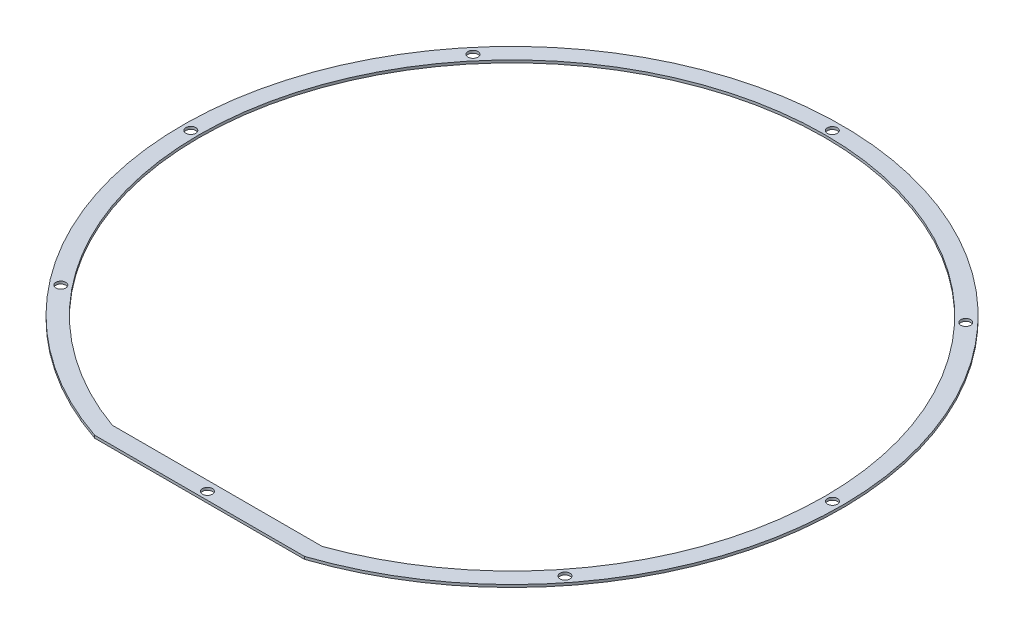
ISO-10303-21;
HEADER;
FILE_DESCRIPTION(('STEP AP214'),'2;1');
FILE_NAME('part.step','',(''),(''),'','','');
FILE_SCHEMA(('AUTOMOTIVE_DESIGN { 1 0 10303 214 1 1 1 1 }'));
ENDSEC;
DATA;
#1=APPLICATION_CONTEXT('core data for automotive mechanical design processes');
#2=APPLICATION_PROTOCOL_DEFINITION('international standard','automotive_design',2000,#1);
#3=PRODUCT_CONTEXT('',#1,'mechanical');
#4=PRODUCT('Part','Part','',(#3));
#5=PRODUCT_RELATED_PRODUCT_CATEGORY('part','',(#4));
#6=PRODUCT_DEFINITION_FORMATION('','',#4);
#7=PRODUCT_DEFINITION_CONTEXT('part definition',#1,'design');
#8=PRODUCT_DEFINITION('design','',#6,#7);
#9=PRODUCT_DEFINITION_SHAPE('','',#8);
#10=(LENGTH_UNIT() NAMED_UNIT(*) SI_UNIT(.MILLI.,.METRE.));
#11=(NAMED_UNIT(*) PLANE_ANGLE_UNIT() SI_UNIT($,.RADIAN.));
#12=(NAMED_UNIT(*) SI_UNIT($,.STERADIAN.) SOLID_ANGLE_UNIT());
#13=UNCERTAINTY_MEASURE_WITH_UNIT(LENGTH_MEASURE(1.E-05),#10,'distance_accuracy_value','');
#14=(GEOMETRIC_REPRESENTATION_CONTEXT(3) GLOBAL_UNCERTAINTY_ASSIGNED_CONTEXT((#13)) GLOBAL_UNIT_ASSIGNED_CONTEXT((#10,
#11,#12)) REPRESENTATION_CONTEXT('',''));
#15=CARTESIAN_POINT('',(0.,0.,0.));
#16=DIRECTION('',(0.,0.,1.));
#17=DIRECTION('',(1.,0.,0.));
#18=AXIS2_PLACEMENT_3D('',#15,#16,#17);
#19=CARTESIAN_POINT('',(-25.4,0.,75.6286215661769));
#20=DIRECTION('',(0.,0.,1.));
#21=DIRECTION('',(1.,0.,0.));
#22=AXIS2_PLACEMENT_3D('',#19,#20,#21);
#23=PLANE('',#22);
#24=DIRECTION('',(0.,1.,0.));
#25=VECTOR('',#24,1.);
#26=CARTESIAN_POINT('',(-25.4,0.,75.6286215661769));
#27=LINE('',#26,#25);
#28=CARTESIAN_POINT('',(-25.4,0.,75.6286215661769));
#29=VERTEX_POINT('',#28);
#30=CARTESIAN_POINT('',(-25.4,0.625,75.6286215661769));
#31=VERTEX_POINT('',#30);
#32=EDGE_CURVE('E13',#29,#31,#27,.T.);
#33=ORIENTED_EDGE('',*,*,#32,.F.);
#34=DIRECTION('',(1.,0.,0.));
#35=VECTOR('',#34,1.);
#36=CARTESIAN_POINT('',(-25.4,0.,75.6286215661769));
#37=LINE('',#36,#35);
#38=CARTESIAN_POINT('',(25.4,0.,75.6286215661769));
#39=VERTEX_POINT('',#38);
#40=EDGE_CURVE('E146',#29,#39,#37,.T.);
#41=ORIENTED_EDGE('',*,*,#40,.T.);
#42=DIRECTION('',(0.,1.,0.));
#43=VECTOR('',#42,1.);
#44=CARTESIAN_POINT('',(25.4,0.,75.6286215661769));
#45=LINE('',#44,#43);
#46=CARTESIAN_POINT('',(25.4,0.625,75.6286215661769));
#47=VERTEX_POINT('',#46);
#48=EDGE_CURVE('E71',#39,#47,#45,.T.);
#49=ORIENTED_EDGE('',*,*,#48,.T.);
#50=DIRECTION('',(1.,0.,0.));
#51=VECTOR('',#50,1.);
#52=CARTESIAN_POINT('',(0.,0.625,75.6286215661769));
#53=LINE('',#52,#51);
#54=EDGE_CURVE('E125',#31,#47,#53,.T.);
#55=ORIENTED_EDGE('',*,*,#54,.F.);
#56=EDGE_LOOP('',(#33,#41,#49,#55));
#57=FACE_BOUND('',#56,.T.);
#58=ADVANCED_FACE('F60',(#57),#23,.T.);
#59=CARTESIAN_POINT('',(0.,0.,0.));
#60=DIRECTION('',(0.,1.,0.));
#61=DIRECTION('',(0.,0.,1.));
#62=AXIS2_PLACEMENT_3D('',#59,#60,#61);
#63=CYLINDRICAL_SURFACE('',#62,75.78);
#64=DIRECTION('',(0.,1.,0.));
#65=VECTOR('',#64,1.);
#66=CARTESIAN_POINT('',(-25.4,0.,71.3964172770595));
#67=LINE('',#66,#65);
#68=CARTESIAN_POINT('',(-25.4,0.,71.3964172770595));
#69=VERTEX_POINT('',#68);
#70=CARTESIAN_POINT('',(-25.4,0.625,71.3964172770595));
#71=VERTEX_POINT('',#70);
#72=EDGE_CURVE('E107',#69,#71,#67,.T.);
#73=ORIENTED_EDGE('',*,*,#72,.F.);
#74=CARTESIAN_POINT('',(0.,0.,0.));
#75=DIRECTION('',(0.,1.,0.));
#76=DIRECTION('',(0.,0.,1.));
#77=AXIS2_PLACEMENT_3D('',#74,#75,#76);
#78=CIRCLE('',#77,75.78);
#79=CARTESIAN_POINT('',(25.4,0.,71.3964172770595));
#80=VERTEX_POINT('',#79);
#81=EDGE_CURVE('E138',#80,#69,#78,.T.);
#82=ORIENTED_EDGE('',*,*,#81,.F.);
#83=DIRECTION('',(0.,1.,0.));
#84=VECTOR('',#83,1.);
#85=CARTESIAN_POINT('',(25.4,0.,71.3964172770595));
#86=LINE('',#85,#84);
#87=CARTESIAN_POINT('',(25.4,0.625,71.3964172770595));
#88=VERTEX_POINT('',#87);
#89=EDGE_CURVE('E101',#80,#88,#86,.T.);
#90=ORIENTED_EDGE('',*,*,#89,.T.);
#91=CARTESIAN_POINT('',(0.,0.625,0.));
#92=DIRECTION('',(0.,1.,0.));
#93=DIRECTION('',(0.,0.,1.));
#94=AXIS2_PLACEMENT_3D('',#91,#92,#93);
#95=CIRCLE('',#94,75.78);
#96=EDGE_CURVE('E116',#88,#71,#95,.T.);
#97=ORIENTED_EDGE('',*,*,#96,.T.);
#98=EDGE_LOOP('',(#73,#82,#90,#97));
#99=FACE_BOUND('',#98,.T.);
#100=ADVANCED_FACE('F117',(#99),#63,.F.);
#101=CARTESIAN_POINT('',(-25.4,0.,71.3964172770595));
#102=DIRECTION('',(0.,0.,1.));
#103=DIRECTION('',(1.,0.,0.));
#104=AXIS2_PLACEMENT_3D('',#101,#102,#103);
#105=PLANE('',#104);
#106=DIRECTION('',(1.,0.,0.));
#107=VECTOR('',#106,1.);
#108=CARTESIAN_POINT('',(-25.4,0.,71.3964172770595));
#109=LINE('',#108,#107);
#110=EDGE_CURVE('E112',#69,#80,#109,.T.);
#111=ORIENTED_EDGE('',*,*,#110,.F.);
#112=ORIENTED_EDGE('',*,*,#72,.T.);
#113=DIRECTION('',(1.,0.,0.));
#114=VECTOR('',#113,1.);
#115=CARTESIAN_POINT('',(0.,0.625,71.3964172770595));
#116=LINE('',#115,#114);
#117=EDGE_CURVE('E110',#71,#88,#116,.T.);
#118=ORIENTED_EDGE('',*,*,#117,.T.);
#119=ORIENTED_EDGE('',*,*,#89,.F.);
#120=EDGE_LOOP('',(#111,#112,#118,#119));
#121=FACE_BOUND('',#120,.T.);
#122=ADVANCED_FACE('F108',(#121),#105,.F.);
#123=CARTESIAN_POINT('',(0.,0.,0.));
#124=DIRECTION('',(0.,1.,0.));
#125=DIRECTION('',(0.,0.,1.));
#126=AXIS2_PLACEMENT_3D('',#123,#124,#125);
#127=CYLINDRICAL_SURFACE('',#126,79.78);
#128=CARTESIAN_POINT('',(0.,0.,0.));
#129=DIRECTION('',(0.,1.,0.));
#130=DIRECTION('',(0.,0.,1.));
#131=AXIS2_PLACEMENT_3D('',#128,#129,#130);
#132=CIRCLE('',#131,79.78);
#133=EDGE_CURVE('E120',#39,#29,#132,.T.);
#134=ORIENTED_EDGE('',*,*,#133,.T.);
#135=ORIENTED_EDGE('',*,*,#32,.T.);
#136=CARTESIAN_POINT('',(0.,0.625,0.));
#137=DIRECTION('',(0.,1.,0.));
#138=DIRECTION('',(0.,0.,1.));
#139=AXIS2_PLACEMENT_3D('',#136,#137,#138);
#140=CIRCLE('',#139,79.78);
#141=EDGE_CURVE('E131',#47,#31,#140,.T.);
#142=ORIENTED_EDGE('',*,*,#141,.F.);
#143=ORIENTED_EDGE('',*,*,#48,.F.);
#144=EDGE_LOOP('',(#134,#135,#142,#143));
#145=FACE_BOUND('',#144,.T.);
#146=ADVANCED_FACE('F62',(#145),#127,.T.);
#147=CARTESIAN_POINT('',(0.,0.625,0.));
#148=DIRECTION('',(0.,1.,0.));
#149=DIRECTION('',(0.,0.,1.));
#150=AXIS2_PLACEMENT_3D('',#147,#148,#149);
#151=PLANE('',#150);
#152=CARTESIAN_POINT('',(0.,0.625,-77.5299542331318));
#153=DIRECTION('',(0.,1.,0.));
#154=DIRECTION('',(0.,0.,1.));
#155=AXIS2_PLACEMENT_3D('',#152,#153,#154);
#156=CIRCLE('',#155,1.2);
#157=CARTESIAN_POINT('',(0.,0.625,-76.3299542331318));
#158=VERTEX_POINT('',#157);
#159=EDGE_CURVE('E217',#158,#158,#156,.T.);
#160=ORIENTED_EDGE('',*,*,#159,.F.);
#161=EDGE_LOOP('',(#160));
#162=FACE_BOUND('',#161,.T.);
#163=CARTESIAN_POINT('',(0.,0.625,73.7448741582289));
#164=DIRECTION('',(0.,1.,0.));
#165=DIRECTION('',(0.,0.,1.));
#166=AXIS2_PLACEMENT_3D('',#163,#164,#165);
#167=CIRCLE('',#166,1.2);
#168=CARTESIAN_POINT('',(0.,0.625,74.9448741582289));
#169=VERTEX_POINT('',#168);
#170=EDGE_CURVE('E200',#169,#169,#167,.T.);
#171=ORIENTED_EDGE('',*,*,#170,.F.);
#172=EDGE_LOOP('',(#171));
#173=FACE_BOUND('',#172,.T.);
#174=CARTESIAN_POINT('',(77.7444696281441,0.625,0.179745533703401));
#175=DIRECTION('',(0.,1.,0.));
#176=DIRECTION('',(0.,0.,1.));
#177=AXIS2_PLACEMENT_3D('',#174,#175,#176);
#178=CIRCLE('',#177,1.20000000000001);
#179=CARTESIAN_POINT('',(77.7444696281441,0.625,1.37974553370341));
#180=VERTEX_POINT('',#179);
#181=EDGE_CURVE('E196',#180,#180,#178,.T.);
#182=ORIENTED_EDGE('',*,*,#181,.F.);
#183=EDGE_LOOP('',(#182));
#184=FACE_BOUND('',#183,.T.);
#185=CARTESIAN_POINT('',(-77.6785765149984,0.625,0.0833278339955738));
#186=DIRECTION('',(0.,1.,0.));
#187=DIRECTION('',(0.,0.,1.));
#188=AXIS2_PLACEMENT_3D('',#185,#186,#187);
#189=CIRCLE('',#188,1.20000000000001);
#190=CARTESIAN_POINT('',(-77.6785765149984,0.625,1.28332783399558));
#191=VERTEX_POINT('',#190);
#192=EDGE_CURVE('E192',#191,#191,#189,.T.);
#193=ORIENTED_EDGE('',*,*,#192,.F.);
#194=EDGE_LOOP('',(#193));
#195=FACE_BOUND('',#194,.T.);
#196=CARTESIAN_POINT('',(56.3719358988549,0.625,-53.4595723703493));
#197=DIRECTION('',(0.,1.,0.));
#198=DIRECTION('',(0.,0.,1.));
#199=AXIS2_PLACEMENT_3D('',#196,#197,#198);
#200=CIRCLE('',#199,1.2);
#201=CARTESIAN_POINT('',(56.3719358988549,0.625,-52.2595723703493));
#202=VERTEX_POINT('',#201);
#203=EDGE_CURVE('E187',#202,#202,#200,.T.);
#204=ORIENTED_EDGE('',*,*,#203,.F.);
#205=EDGE_LOOP('',(#204));
#206=FACE_BOUND('',#205,.T.);
#207=CARTESIAN_POINT('',(-59.4820600213092,0.625,-50.0231421649506));
#208=DIRECTION('',(0.,1.,0.));
#209=DIRECTION('',(0.,0.,1.));
#210=AXIS2_PLACEMENT_3D('',#207,#208,#209);
#211=CIRCLE('',#210,1.2);
#212=CARTESIAN_POINT('',(-59.4820600213092,0.625,-48.8231421649506));
#213=VERTEX_POINT('',#212);
#214=EDGE_CURVE('E182',#213,#213,#211,.T.);
#215=ORIENTED_EDGE('',*,*,#214,.F.);
#216=EDGE_LOOP('',(#215));
#217=FACE_BOUND('',#216,.T.);
#218=CARTESIAN_POINT('',(61.035706747997,0.625,48.2208600148221));
#219=DIRECTION('',(0.,1.,0.));
#220=DIRECTION('',(0.,0.,1.));
#221=AXIS2_PLACEMENT_3D('',#218,#219,#220);
#222=CIRCLE('',#221,1.2);
#223=CARTESIAN_POINT('',(61.035706747997,0.625,49.4208600148221));
#224=VERTEX_POINT('',#223);
#225=EDGE_CURVE('E177',#224,#224,#222,.T.);
#226=ORIENTED_EDGE('',*,*,#225,.F.);
#227=EDGE_LOOP('',(#226));
#228=FACE_BOUND('',#227,.T.);
#229=CARTESIAN_POINT('',(-60.9825170015056,0.625,48.2583098483634));
#230=DIRECTION('',(0.,1.,0.));
#231=DIRECTION('',(0.,0.,1.));
#232=AXIS2_PLACEMENT_3D('',#229,#230,#231);
#233=CIRCLE('',#232,1.2);
#234=CARTESIAN_POINT('',(-60.9825170015056,0.625,49.4583098483634));
#235=VERTEX_POINT('',#234);
#236=EDGE_CURVE('E172',#235,#235,#233,.T.);
#237=ORIENTED_EDGE('',*,*,#236,.F.);
#238=EDGE_LOOP('',(#237));
#239=FACE_BOUND('',#238,.T.);
#240=ORIENTED_EDGE('',*,*,#96,.F.);
#241=ORIENTED_EDGE('',*,*,#117,.F.);
#242=EDGE_LOOP('',(#240,#241));
#243=FACE_BOUND('',#242,.T.);
#244=ORIENTED_EDGE('',*,*,#54,.T.);
#245=ORIENTED_EDGE('',*,*,#141,.T.);
#246=EDGE_LOOP('',(#244,#245));
#247=FACE_BOUND('',#246,.T.);
#248=ADVANCED_FACE('F122',(#162,#173,#184,#195,#206,#217,#228,#239,#243,#247),#151,.T.);
#249=CARTESIAN_POINT('',(0.,0.,0.));
#250=DIRECTION('',(0.,1.,0.));
#251=DIRECTION('',(0.,0.,1.));
#252=AXIS2_PLACEMENT_3D('',#249,#250,#251);
#253=PLANE('',#252);
#254=CARTESIAN_POINT('',(0.,0.,-77.5299542331318));
#255=DIRECTION('',(0.,1.,0.));
#256=DIRECTION('',(0.,0.,1.));
#257=AXIS2_PLACEMENT_3D('',#254,#255,#256);
#258=CIRCLE('',#257,1.2);
#259=CARTESIAN_POINT('',(0.,0.,-76.3299542331318));
#260=VERTEX_POINT('',#259);
#261=EDGE_CURVE('E64',#260,#260,#258,.T.);
#262=ORIENTED_EDGE('',*,*,#261,.T.);
#263=EDGE_LOOP('',(#262));
#264=FACE_BOUND('',#263,.T.);
#265=CARTESIAN_POINT('',(0.,0.,73.7448741582289));
#266=DIRECTION('',(0.,1.,0.));
#267=DIRECTION('',(0.,0.,1.));
#268=AXIS2_PLACEMENT_3D('',#265,#266,#267);
#269=CIRCLE('',#268,1.2);
#270=CARTESIAN_POINT('',(0.,0.,74.9448741582289));
#271=VERTEX_POINT('',#270);
#272=EDGE_CURVE('E197',#271,#271,#269,.T.);
#273=ORIENTED_EDGE('',*,*,#272,.T.);
#274=EDGE_LOOP('',(#273));
#275=FACE_BOUND('',#274,.T.);
#276=CARTESIAN_POINT('',(77.7444696281441,0.,0.179745533703401));
#277=DIRECTION('',(0.,1.,0.));
#278=DIRECTION('',(0.,0.,1.));
#279=AXIS2_PLACEMENT_3D('',#276,#277,#278);
#280=CIRCLE('',#279,1.20000000000001);
#281=CARTESIAN_POINT('',(77.7444696281441,0.,1.37974553370341));
#282=VERTEX_POINT('',#281);
#283=EDGE_CURVE('E193',#282,#282,#280,.T.);
#284=ORIENTED_EDGE('',*,*,#283,.T.);
#285=EDGE_LOOP('',(#284));
#286=FACE_BOUND('',#285,.T.);
#287=CARTESIAN_POINT('',(-77.6785765149984,0.,0.0833278339955738));
#288=DIRECTION('',(0.,1.,0.));
#289=DIRECTION('',(0.,0.,1.));
#290=AXIS2_PLACEMENT_3D('',#287,#288,#289);
#291=CIRCLE('',#290,1.20000000000001);
#292=CARTESIAN_POINT('',(-77.6785765149984,0.,1.28332783399558));
#293=VERTEX_POINT('',#292);
#294=EDGE_CURVE('E188',#293,#293,#291,.T.);
#295=ORIENTED_EDGE('',*,*,#294,.T.);
#296=EDGE_LOOP('',(#295));
#297=FACE_BOUND('',#296,.T.);
#298=CARTESIAN_POINT('',(56.3719358988549,0.,-53.4595723703493));
#299=DIRECTION('',(0.,1.,0.));
#300=DIRECTION('',(0.,0.,1.));
#301=AXIS2_PLACEMENT_3D('',#298,#299,#300);
#302=CIRCLE('',#301,1.2);
#303=CARTESIAN_POINT('',(56.3719358988549,0.,-52.2595723703493));
#304=VERTEX_POINT('',#303);
#305=EDGE_CURVE('E183',#304,#304,#302,.T.);
#306=ORIENTED_EDGE('',*,*,#305,.T.);
#307=EDGE_LOOP('',(#306));
#308=FACE_BOUND('',#307,.T.);
#309=CARTESIAN_POINT('',(-59.4820600213092,0.,-50.0231421649506));
#310=DIRECTION('',(0.,1.,0.));
#311=DIRECTION('',(0.,0.,1.));
#312=AXIS2_PLACEMENT_3D('',#309,#310,#311);
#313=CIRCLE('',#312,1.2);
#314=CARTESIAN_POINT('',(-59.4820600213092,0.,-48.8231421649506));
#315=VERTEX_POINT('',#314);
#316=EDGE_CURVE('E178',#315,#315,#313,.T.);
#317=ORIENTED_EDGE('',*,*,#316,.T.);
#318=EDGE_LOOP('',(#317));
#319=FACE_BOUND('',#318,.T.);
#320=CARTESIAN_POINT('',(61.035706747997,0.,48.2208600148221));
#321=DIRECTION('',(0.,1.,0.));
#322=DIRECTION('',(0.,0.,1.));
#323=AXIS2_PLACEMENT_3D('',#320,#321,#322);
#324=CIRCLE('',#323,1.2);
#325=CARTESIAN_POINT('',(61.035706747997,0.,49.4208600148221));
#326=VERTEX_POINT('',#325);
#327=EDGE_CURVE('E173',#326,#326,#324,.T.);
#328=ORIENTED_EDGE('',*,*,#327,.T.);
#329=EDGE_LOOP('',(#328));
#330=FACE_BOUND('',#329,.T.);
#331=CARTESIAN_POINT('',(-60.9825170015056,0.,48.2583098483634));
#332=DIRECTION('',(0.,1.,0.));
#333=DIRECTION('',(0.,0.,1.));
#334=AXIS2_PLACEMENT_3D('',#331,#332,#333);
#335=CIRCLE('',#334,1.2);
#336=CARTESIAN_POINT('',(-60.9825170015056,0.,49.4583098483634));
#337=VERTEX_POINT('',#336);
#338=EDGE_CURVE('E141',#337,#337,#335,.T.);
#339=ORIENTED_EDGE('',*,*,#338,.T.);
#340=EDGE_LOOP('',(#339));
#341=FACE_BOUND('',#340,.T.);
#342=ORIENTED_EDGE('',*,*,#81,.T.);
#343=ORIENTED_EDGE('',*,*,#110,.T.);
#344=EDGE_LOOP('',(#342,#343));
#345=FACE_BOUND('',#344,.T.);
#346=ORIENTED_EDGE('',*,*,#40,.F.);
#347=ORIENTED_EDGE('',*,*,#133,.F.);
#348=EDGE_LOOP('',(#346,#347));
#349=FACE_BOUND('',#348,.T.);
#350=ADVANCED_FACE('F241',(#264,#275,#286,#297,#308,#319,#330,#341,#345,#349),#253,.F.);
#351=CARTESIAN_POINT('',(-60.9825170015056,0.625,48.2583098483634));
#352=DIRECTION('',(0.,1.,0.));
#353=DIRECTION('',(0.,0.,1.));
#354=AXIS2_PLACEMENT_3D('',#351,#352,#353);
#355=CYLINDRICAL_SURFACE('',#354,1.2);
#356=ORIENTED_EDGE('',*,*,#236,.T.);
#357=EDGE_LOOP('',(#356));
#358=FACE_BOUND('',#357,.T.);
#359=ORIENTED_EDGE('',*,*,#338,.F.);
#360=EDGE_LOOP('',(#359));
#361=FACE_BOUND('',#360,.T.);
#362=ADVANCED_FACE('F237',(#358,#361),#355,.F.);
#363=CARTESIAN_POINT('',(61.035706747997,0.625,48.2208600148221));
#364=DIRECTION('',(0.,1.,0.));
#365=DIRECTION('',(0.,0.,1.));
#366=AXIS2_PLACEMENT_3D('',#363,#364,#365);
#367=CYLINDRICAL_SURFACE('',#366,1.2);
#368=ORIENTED_EDGE('',*,*,#225,.T.);
#369=EDGE_LOOP('',(#368));
#370=FACE_BOUND('',#369,.T.);
#371=ORIENTED_EDGE('',*,*,#327,.F.);
#372=EDGE_LOOP('',(#371));
#373=FACE_BOUND('',#372,.T.);
#374=ADVANCED_FACE('F290',(#370,#373),#367,.F.);
#375=CARTESIAN_POINT('',(-59.4820600213092,0.625,-50.0231421649506));
#376=DIRECTION('',(0.,1.,0.));
#377=DIRECTION('',(0.,0.,1.));
#378=AXIS2_PLACEMENT_3D('',#375,#376,#377);
#379=CYLINDRICAL_SURFACE('',#378,1.2);
#380=ORIENTED_EDGE('',*,*,#214,.T.);
#381=EDGE_LOOP('',(#380));
#382=FACE_BOUND('',#381,.T.);
#383=ORIENTED_EDGE('',*,*,#316,.F.);
#384=EDGE_LOOP('',(#383));
#385=FACE_BOUND('',#384,.T.);
#386=ADVANCED_FACE('F299',(#382,#385),#379,.F.);
#387=CARTESIAN_POINT('',(56.3719358988549,0.625,-53.4595723703493));
#388=DIRECTION('',(0.,1.,0.));
#389=DIRECTION('',(0.,0.,1.));
#390=AXIS2_PLACEMENT_3D('',#387,#388,#389);
#391=CYLINDRICAL_SURFACE('',#390,1.2);
#392=ORIENTED_EDGE('',*,*,#203,.T.);
#393=EDGE_LOOP('',(#392));
#394=FACE_BOUND('',#393,.T.);
#395=ORIENTED_EDGE('',*,*,#305,.F.);
#396=EDGE_LOOP('',(#395));
#397=FACE_BOUND('',#396,.T.);
#398=ADVANCED_FACE('F310',(#394,#397),#391,.F.);
#399=CARTESIAN_POINT('',(-77.6785765149984,0.625,0.0833278339955738));
#400=DIRECTION('',(0.,1.,0.));
#401=DIRECTION('',(0.,0.,1.));
#402=AXIS2_PLACEMENT_3D('',#399,#400,#401);
#403=CYLINDRICAL_SURFACE('',#402,1.20000000000001);
#404=ORIENTED_EDGE('',*,*,#192,.T.);
#405=EDGE_LOOP('',(#404));
#406=FACE_BOUND('',#405,.T.);
#407=ORIENTED_EDGE('',*,*,#294,.F.);
#408=EDGE_LOOP('',(#407));
#409=FACE_BOUND('',#408,.T.);
#410=ADVANCED_FACE('F321',(#406,#409),#403,.F.);
#411=CARTESIAN_POINT('',(77.7444696281441,0.625,0.179745533703401));
#412=DIRECTION('',(0.,1.,0.));
#413=DIRECTION('',(0.,0.,1.));
#414=AXIS2_PLACEMENT_3D('',#411,#412,#413);
#415=CYLINDRICAL_SURFACE('',#414,1.20000000000001);
#416=ORIENTED_EDGE('',*,*,#181,.T.);
#417=EDGE_LOOP('',(#416));
#418=FACE_BOUND('',#417,.T.);
#419=ORIENTED_EDGE('',*,*,#283,.F.);
#420=EDGE_LOOP('',(#419));
#421=FACE_BOUND('',#420,.T.);
#422=ADVANCED_FACE('F332',(#418,#421),#415,.F.);
#423=CARTESIAN_POINT('',(0.,0.625,73.7448741582289));
#424=DIRECTION('',(0.,1.,0.));
#425=DIRECTION('',(0.,0.,1.));
#426=AXIS2_PLACEMENT_3D('',#423,#424,#425);
#427=CYLINDRICAL_SURFACE('',#426,1.2);
#428=ORIENTED_EDGE('',*,*,#170,.T.);
#429=EDGE_LOOP('',(#428));
#430=FACE_BOUND('',#429,.T.);
#431=ORIENTED_EDGE('',*,*,#272,.F.);
#432=EDGE_LOOP('',(#431));
#433=FACE_BOUND('',#432,.T.);
#434=ADVANCED_FACE('F343',(#430,#433),#427,.F.);
#435=CARTESIAN_POINT('',(0.,0.625,-77.5299542331318));
#436=DIRECTION('',(0.,1.,0.));
#437=DIRECTION('',(0.,0.,1.));
#438=AXIS2_PLACEMENT_3D('',#435,#436,#437);
#439=CYLINDRICAL_SURFACE('',#438,1.2);
#440=ORIENTED_EDGE('',*,*,#159,.T.);
#441=EDGE_LOOP('',(#440));
#442=FACE_BOUND('',#441,.T.);
#443=ORIENTED_EDGE('',*,*,#261,.F.);
#444=EDGE_LOOP('',(#443));
#445=FACE_BOUND('',#444,.T.);
#446=ADVANCED_FACE('F354',(#442,#445),#439,.F.);
#447=CLOSED_SHELL('',(#58,#100,#122,#146,#248,#350,#362,#374,#386,#398,#410,#422,#434,#446));
#448=MANIFOLD_SOLID_BREP('B2',#447);
#449=ADVANCED_BREP_SHAPE_REPRESENTATION('',(#18,#448),#14);
#450=SHAPE_DEFINITION_REPRESENTATION(#9,#449);
ENDSEC;
END-ISO-10303-21;
